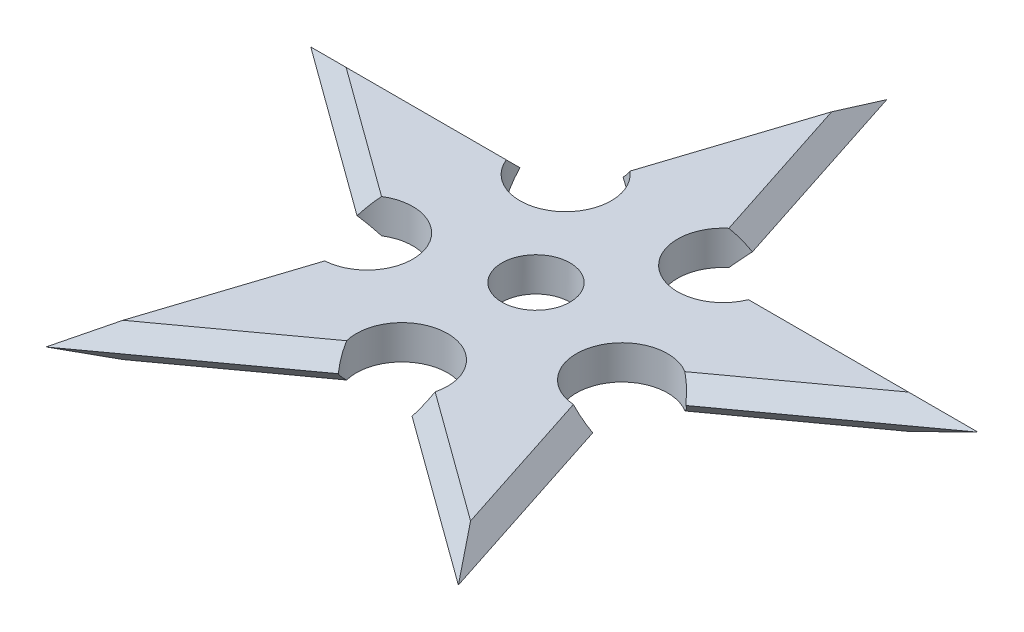
ISO-10303-21;
HEADER;
FILE_DESCRIPTION(('STEP AP214'),'2;1');
FILE_NAME('part.step','',(''),(''),'','','');
FILE_SCHEMA(('AUTOMOTIVE_DESIGN { 1 0 10303 214 1 1 1 1 }'));
ENDSEC;
DATA;
#1=APPLICATION_CONTEXT('core data for automotive mechanical design processes');
#2=APPLICATION_PROTOCOL_DEFINITION('international standard','automotive_design',2000,#1);
#3=PRODUCT_CONTEXT('',#1,'mechanical');
#4=PRODUCT('Part','Part','',(#3));
#5=PRODUCT_RELATED_PRODUCT_CATEGORY('part','',(#4));
#6=PRODUCT_DEFINITION_FORMATION('','',#4);
#7=PRODUCT_DEFINITION_CONTEXT('part definition',#1,'design');
#8=PRODUCT_DEFINITION('design','',#6,#7);
#9=PRODUCT_DEFINITION_SHAPE('','',#8);
#10=(LENGTH_UNIT() NAMED_UNIT(*) SI_UNIT(.MILLI.,.METRE.));
#11=(NAMED_UNIT(*) PLANE_ANGLE_UNIT() SI_UNIT($,.RADIAN.));
#12=(NAMED_UNIT(*) SI_UNIT($,.STERADIAN.) SOLID_ANGLE_UNIT());
#13=UNCERTAINTY_MEASURE_WITH_UNIT(LENGTH_MEASURE(1.E-05),#10,'distance_accuracy_value','');
#14=(GEOMETRIC_REPRESENTATION_CONTEXT(3) GLOBAL_UNCERTAINTY_ASSIGNED_CONTEXT((#13)) GLOBAL_UNIT_ASSIGNED_CONTEXT((#10,
#11,#12)) REPRESENTATION_CONTEXT('',''));
#15=CARTESIAN_POINT('',(0.,0.,0.));
#16=DIRECTION('',(0.,0.,1.));
#17=DIRECTION('',(1.,0.,0.));
#18=AXIS2_PLACEMENT_3D('',#15,#16,#17);
#19=CARTESIAN_POINT('',(6.93786378564481,1.5,-9.54915028125318));
#20=DIRECTION('',(0.,1.,0.));
#21=DIRECTION('',(0.,0.,1.));
#22=AXIS2_PLACEMENT_3D('',#19,#20,#21);
#23=PLANE('',#22);
#24=CARTESIAN_POINT('',(-11.2256994144895,1.5,3.64745084375751));
#25=DIRECTION('',(0.,1.,0.));
#26=DIRECTION('',(0.,0.,1.));
#27=AXIS2_PLACEMENT_3D('',#24,#25,#26);
#28=CIRCLE('',#27,4.02000000000031);
#29=CARTESIAN_POINT('',(-10.9516444664403,1.5,7.65809840811071));
#30=VERTEX_POINT('',#29);
#31=CARTESIAN_POINT('',(-13.3613837945935,1.5,0.241683348965438));
#32=VERTEX_POINT('',#31);
#33=EDGE_CURVE('E817',#30,#32,#28,.T.);
#34=ORIENTED_EDGE('',*,*,#33,.F.);
#35=DIRECTION('',(-0.309016994375039,0.,0.951056516295124));
#36=VECTOR('',#35,1.);
#37=CARTESIAN_POINT('',(-10.9449803231336,1.5,7.63758828396602));
#38=LINE('',#37,#36);
#39=CARTESIAN_POINT('',(-15.3103936512505,1.5,21.0729490168727));
#40=VERTEX_POINT('',#39);
#41=EDGE_CURVE('E375',#30,#40,#38,.T.);
#42=ORIENTED_EDGE('',*,*,#41,.T.);
#43=DIRECTION('',(0.809016994374994,0.,-0.587785252292409));
#44=VECTOR('',#43,1.);
#45=CARTESIAN_POINT('',(-15.3103936512505,1.5,21.0729490168727));
#46=LINE('',#45,#44);
#47=CARTESIAN_POINT('',(-3.89904013698226,1.5,12.7821153866547));
#48=VERTEX_POINT('',#47);
#49=EDGE_CURVE('E371',#40,#48,#46,.T.);
#50=ORIENTED_EDGE('',*,*,#49,.T.);
#51=CARTESIAN_POINT('',(2.4800024458701E-13,1.5,11.8033988749894));
#52=DIRECTION('',(0.,1.,0.));
#53=DIRECTION('',(0.,0.,1.));
#54=AXIS2_PLACEMENT_3D('',#51,#52,#53);
#55=CIRCLE('',#54,4.02000000000086);
#56=CARTESIAN_POINT('',(3.89904013698215,1.5,12.7821153866571));
#57=VERTEX_POINT('',#56);
#58=EDGE_CURVE('E388',#57,#48,#55,.T.);
#59=ORIENTED_EDGE('',*,*,#58,.F.);
#60=DIRECTION('',(0.809016994374945,0.,0.587785252292476));
#61=VECTOR('',#60,1.);
#62=CARTESIAN_POINT('',(3.88159318329884,1.5,12.7694394328221));
#63=LINE('',#62,#61);
#64=CARTESIAN_POINT('',(15.3103936512489,1.5,21.0729490168754));
#65=VERTEX_POINT('',#64);
#66=EDGE_CURVE('E361',#57,#65,#63,.T.);
#67=ORIENTED_EDGE('',*,*,#66,.T.);
#68=DIRECTION('',(-0.309016994374896,0.,-0.95105651629517));
#69=VECTOR('',#68,1.);
#70=CARTESIAN_POINT('',(15.3103936512489,1.5,21.0729490168754));
#71=LINE('',#70,#69);
#72=CARTESIAN_POINT('',(10.9516444664404,1.5,7.65809840811167));
#73=VERTEX_POINT('',#72);
#74=EDGE_CURVE('E78',#65,#73,#71,.T.);
#75=ORIENTED_EDGE('',*,*,#74,.T.);
#76=CARTESIAN_POINT('',(11.2256994144902,1.5,3.64745084375781));
#77=DIRECTION('',(0.,1.,0.));
#78=DIRECTION('',(0.,0.,1.));
#79=AXIS2_PLACEMENT_3D('',#76,#77,#78);
#80=CIRCLE('',#79,4.02000000000102);
#81=CARTESIAN_POINT('',(13.3613837945943,1.5,0.241683348964948));
#82=VERTEX_POINT('',#81);
#83=EDGE_CURVE('E240',#82,#73,#80,.T.);
#84=ORIENTED_EDGE('',*,*,#83,.F.);
#85=DIRECTION('',(0.809016994374994,0.,-0.587785252292409));
#86=VECTOR('',#85,1.);
#87=CARTESIAN_POINT('',(13.343936840911,1.5,0.2543593028));
#88=LINE('',#87,#86);
#89=CARTESIAN_POINT('',(24.772737308862,1.5,-8.04915028125262));
#90=VERTEX_POINT('',#89);
#91=EDGE_CURVE('E261',#82,#90,#88,.T.);
#92=ORIENTED_EDGE('',*,*,#91,.T.);
#93=DIRECTION('',(-1.,0.,0.));
#94=VECTOR('',#93,1.);
#95=CARTESIAN_POINT('',(24.772737308862,1.5,-8.04915028125262));
#96=LINE('',#95,#94);
#97=CARTESIAN_POINT('',(10.6675286499463,1.5,-8.0491502812527));
#98=VERTEX_POINT('',#97);
#99=EDGE_CURVE('E247',#90,#98,#96,.T.);
#100=ORIENTED_EDGE('',*,*,#99,.T.);
#101=CARTESIAN_POINT('',(6.93786378564504,1.5,-9.54915028125299));
#102=DIRECTION('',(0.,1.,0.));
#103=DIRECTION('',(0.,0.,1.));
#104=AXIS2_PLACEMENT_3D('',#101,#102,#103);
#105=CIRCLE('',#104,4.02000000000051);
#106=CARTESIAN_POINT('',(4.35874918481123,1.5,-12.6327468624824));
#107=VERTEX_POINT('',#106);
#108=EDGE_CURVE('E228',#107,#98,#105,.T.);
#109=ORIENTED_EDGE('',*,*,#108,.F.);
#110=DIRECTION('',(-0.309016994374896,0.,-0.95105651629517));
#111=VECTOR('',#110,1.);
#112=CARTESIAN_POINT('',(4.36541332811794,1.5,-12.612236738338));
#113=LINE('',#112,#111);
#114=CARTESIAN_POINT('',(2.64588698173363E-12,1.5,-26.0475974712463));
#115=VERTEX_POINT('',#114);
#116=EDGE_CURVE('E264',#107,#115,#113,.T.);
#117=ORIENTED_EDGE('',*,*,#116,.T.);
#118=DIRECTION('',(-0.309016994375039,0.,0.951056516295124));
#119=VECTOR('',#118,1.);
#120=CARTESIAN_POINT('',(2.64588698173363E-12,1.5,-26.0475974712463));
#121=LINE('',#120,#119);
#122=CARTESIAN_POINT('',(-4.35874918480871,1.5,-12.6327468624807));
#123=VERTEX_POINT('',#122);
#124=EDGE_CURVE('E347',#115,#123,#121,.T.);
#125=ORIENTED_EDGE('',*,*,#124,.T.);
#126=CARTESIAN_POINT('',(-6.93786378564397,1.5,-9.54915028125318));
#127=DIRECTION('',(0.,1.,0.));
#128=DIRECTION('',(0.,0.,1.));
#129=AXIS2_PLACEMENT_3D('',#126,#127,#128);
#130=CIRCLE('',#129,4.02);
#131=CARTESIAN_POINT('',(-10.6675286499446,1.5,-8.04915028125261));
#132=VERTEX_POINT('',#131);
#133=EDGE_CURVE('E991',#132,#123,#130,.T.);
#134=ORIENTED_EDGE('',*,*,#133,.F.);
#135=DIRECTION('',(-1.,0.,0.));
#136=VECTOR('',#135,1.);
#137=CARTESIAN_POINT('',(-10.6459630291925,1.5,-8.04915028125262));
#138=LINE('',#137,#136);
#139=CARTESIAN_POINT('',(-24.7727373088597,1.5,-8.04915028125261));
#140=VERTEX_POINT('',#139);
#141=EDGE_CURVE('E472',#132,#140,#138,.T.);
#142=ORIENTED_EDGE('',*,*,#141,.T.);
#143=DIRECTION('',(0.80901699437494,0.,0.587785252292484));
#144=VECTOR('',#143,1.);
#145=CARTESIAN_POINT('',(-24.7727373088597,1.5,-8.04915028125261));
#146=LINE('',#145,#144);
#147=EDGE_CURVE('E812',#140,#32,#146,.T.);
#148=ORIENTED_EDGE('',*,*,#147,.T.);
#149=EDGE_LOOP('',(#34,#42,#50,#59,#67,#75,#84,#92,#100,#109,#117,#125,#134,#142,#148));
#150=FACE_BOUND('',#149,.T.);
#151=CARTESIAN_POINT('',(0.,1.5,0.));
#152=DIRECTION('',(0.,1.,0.));
#153=DIRECTION('',(0.,0.,1.));
#154=AXIS2_PLACEMENT_3D('',#151,#152,#153);
#155=CIRCLE('',#154,3.);
#156=CARTESIAN_POINT('',(0.,1.5,3.));
#157=VERTEX_POINT('',#156);
#158=EDGE_CURVE('E239',#157,#157,#155,.T.);
#159=ORIENTED_EDGE('',*,*,#158,.F.);
#160=EDGE_LOOP('',(#159));
#161=FACE_BOUND('',#160,.T.);
#162=ADVANCED_FACE('F73',(#150,#161),#23,.T.);
#163=CARTESIAN_POINT('',(2.80642485362174,4.7745751406257,3.86271242968656));
#164=DIRECTION('',(0.415626937777408,0.707106781186548,0.572061402817717));
#165=DIRECTION('',(0.,-0.628960169645115,0.777437524821119));
#166=AXIS2_PLACEMENT_3D('',#163,#164,#165);
#167=PLANE('',#166);
#168=CARTESIAN_POINT('',(11.2256994144902,-9.40220123979429E-13,3.64745084375781));
#169=DIRECTION('',(0.415626937777408,0.707106781186548,0.572061402817717));
#170=DIRECTION('',(-0.415626937777409,0.707106781186547,-0.572061402817717));
#171=AXIS2_PLACEMENT_3D('',#168,#169,#170);
#172=ELLIPSE('',#171,5.68513852074128,4.02000000000102);
#173=CARTESIAN_POINT('',(14.4779477318779,0.,1.28455412954096));
#174=VERTEX_POINT('',#173);
#175=EDGE_CURVE('E521',#174,#82,#172,.T.);
#176=ORIENTED_EDGE('',*,*,#175,.F.);
#177=DIRECTION('',(0.809016994374994,0.,-0.587785252292409));
#178=VECTOR('',#177,1.);
#179=CARTESIAN_POINT('',(14.4617673919904,0.,1.29630983458683));
#180=LINE('',#179,#178);
#181=CARTESIAN_POINT('',(29.3892626146256,0.,-9.54915028125269));
#182=VERTEX_POINT('',#181);
#183=EDGE_CURVE('E523',#174,#182,#180,.T.);
#184=ORIENTED_EDGE('',*,*,#183,.T.);
#185=DIRECTION('',(0.908660854566047,-0.295241808844287,-0.295241808844301));
#186=VECTOR('',#185,1.);
#187=CARTESIAN_POINT('',(24.772737308862,1.5,-8.04915028125262));
#188=LINE('',#187,#186);
#189=EDGE_CURVE('E370',#90,#182,#188,.T.);
#190=ORIENTED_EDGE('',*,*,#189,.F.);
#191=ORIENTED_EDGE('',*,*,#91,.F.);
#192=EDGE_LOOP('',(#176,#184,#190,#191));
#193=FACE_BOUND('',#192,.T.);
#194=ADVANCED_FACE('F286',(#193),#167,.T.);
#195=CARTESIAN_POINT('',(0.,4.77457514062653,-4.77457514062602));
#196=DIRECTION('',(0.,0.707106781186585,-0.70710678118651));
#197=DIRECTION('',(0.,0.70710678118651,0.707106781186585));
#198=AXIS2_PLACEMENT_3D('',#195,#196,#197);
#199=PLANE('',#198);
#200=CARTESIAN_POINT('',(6.93786378564504,0.,-9.54915028125299));
#201=DIRECTION('',(0.,0.707106781186585,-0.70710678118651));
#202=DIRECTION('',(0.,0.70710678118651,0.707106781186585));
#203=AXIS2_PLACEMENT_3D('',#200,#201,#202);
#204=ELLIPSE('',#203,5.68513852074027,4.02000000000051);
#205=CARTESIAN_POINT('',(10.9578637856456,0.,-9.54915028125284));
#206=VERTEX_POINT('',#205);
#207=EDGE_CURVE('E231',#98,#206,#204,.T.);
#208=ORIENTED_EDGE('',*,*,#207,.F.);
#209=ORIENTED_EDGE('',*,*,#99,.F.);
#210=ORIENTED_EDGE('',*,*,#189,.T.);
#211=DIRECTION('',(-1.,0.,0.));
#212=VECTOR('',#211,1.);
#213=CARTESIAN_POINT('',(10.9378637856456,0.,-9.54915028125284));
#214=LINE('',#213,#212);
#215=EDGE_CURVE('E251',#182,#206,#214,.T.);
#216=ORIENTED_EDGE('',*,*,#215,.T.);
#217=EDGE_LOOP('',(#208,#209,#210,#216));
#218=FACE_BOUND('',#217,.T.);
#219=ADVANCED_FACE('F245',(#218),#199,.T.);
#220=CARTESIAN_POINT('',(4.54089080003433,4.7745751406271,-1.47542485937368));
#221=DIRECTION('',(0.672498511963969,0.707106781186548,-0.218508012224374));
#222=DIRECTION('',(-0.724617040067441,0.689151757774658,0.));
#223=AXIS2_PLACEMENT_3D('',#220,#221,#222);
#224=PLANE('',#223);
#225=CARTESIAN_POINT('',(11.2256994144902,6.50521303491303E-13,3.64745084375781));
#226=DIRECTION('',(0.672498511963969,0.707106781186548,-0.218508012224374));
#227=DIRECTION('',(-0.67249851196397,0.707106781186547,0.218508012224374));
#228=AXIS2_PLACEMENT_3D('',#225,#226,#227);
#229=ELLIPSE('',#228,5.68513852074128,4.02000000000102);
#230=CARTESIAN_POINT('',(12.4679477318782,0.,7.47069803926516));
#231=VERTEX_POINT('',#230);
#232=EDGE_CURVE('E92',#73,#231,#229,.T.);
#233=ORIENTED_EDGE('',*,*,#232,.F.);
#234=ORIENTED_EDGE('',*,*,#74,.F.);
#235=DIRECTION('',(0.561583292368303,-0.295241808844347,0.772953090454457));
#236=VECTOR('',#235,1.);
#237=CARTESIAN_POINT('',(15.3103936512489,1.5,21.0729490168754));
#238=LINE('',#237,#236);
#239=CARTESIAN_POINT('',(18.163563200134,0.,25.0000000000001));
#240=VERTEX_POINT('',#239);
#241=EDGE_CURVE('E409',#65,#240,#238,.T.);
#242=ORIENTED_EDGE('',*,*,#241,.T.);
#243=DIRECTION('',(-0.309016994374896,0.,-0.95105651629517));
#244=VECTOR('',#243,1.);
#245=CARTESIAN_POINT('',(18.163563200134,0.,25.0000000000001));
#246=LINE('',#245,#244);
#247=EDGE_CURVE('E528',#240,#231,#246,.T.);
#248=ORIENTED_EDGE('',*,*,#247,.T.);
#249=EDGE_LOOP('',(#233,#234,#242,#248));
#250=FACE_BOUND('',#249,.T.);
#251=ADVANCED_FACE('F490',(#250),#224,.T.);
#252=CARTESIAN_POINT('',(-2.8064248536224,4.77457514062628,3.8627124296868));
#253=DIRECTION('',(-0.415626937777456,0.707106781186548,0.572061402817683));
#254=DIRECTION('',(0.,-0.628960169645093,0.777437524821137));
#255=AXIS2_PLACEMENT_3D('',#252,#253,#254);
#256=PLANE('',#255);
#257=CARTESIAN_POINT('',(2.4800024458701E-13,1.75207071073658E-13,11.8033988749894));
#258=DIRECTION('',(-0.415626937777456,0.707106781186548,0.572061402817683));
#259=DIRECTION('',(0.415626937777456,0.707106781186547,-0.572061402817683));
#260=AXIS2_PLACEMENT_3D('',#257,#258,#259);
#261=ELLIPSE('',#260,5.68513852074106,4.02000000000086);
#262=CARTESIAN_POINT('',(3.25224831738812,0.,14.1662955892058));
#263=VERTEX_POINT('',#262);
#264=EDGE_CURVE('E898',#263,#57,#261,.T.);
#265=ORIENTED_EDGE('',*,*,#264,.F.);
#266=DIRECTION('',(0.809016994374945,0.,0.587785252292476));
#267=VECTOR('',#266,1.);
#268=CARTESIAN_POINT('',(3.2360679775008,0.,14.1545398841601));
#269=LINE('',#268,#267);
#270=EDGE_CURVE('E696',#263,#240,#269,.T.);
#271=ORIENTED_EDGE('',*,*,#270,.T.);
#272=ORIENTED_EDGE('',*,*,#241,.F.);
#273=ORIENTED_EDGE('',*,*,#66,.F.);
#274=EDGE_LOOP('',(#265,#271,#272,#273));
#275=FACE_BOUND('',#274,.T.);
#276=ADVANCED_FACE('F481',(#275),#256,.T.);
#277=CARTESIAN_POINT('',(2.80642485362175,4.7745751406257,3.86271242968658));
#278=DIRECTION('',(0.415626937777409,0.707106781186547,0.572061402817718));
#279=DIRECTION('',(0.,-0.628960169645117,0.777437524821118));
#280=AXIS2_PLACEMENT_3D('',#277,#278,#279);
#281=PLANE('',#280);
#282=CARTESIAN_POINT('',(2.4800024458701E-13,-1.84401105496335E-12,11.8033988749894));
#283=DIRECTION('',(0.415626937777409,0.707106781186547,0.572061402817718));
#284=DIRECTION('',(-0.415626937777408,0.707106781186548,-0.572061402817716));
#285=AXIS2_PLACEMENT_3D('',#282,#283,#284);
#286=ELLIPSE('',#285,5.68513852074107,4.02000000000086);
#287=CARTESIAN_POINT('',(-3.25224831738901,0.,14.1662955892039));
#288=VERTEX_POINT('',#287);
#289=EDGE_CURVE('E100',#48,#288,#286,.T.);
#290=ORIENTED_EDGE('',*,*,#289,.F.);
#291=ORIENTED_EDGE('',*,*,#49,.F.);
#292=DIRECTION('',(-0.561583292368398,-0.295241808844319,0.772953090454398));
#293=VECTOR('',#292,1.);
#294=CARTESIAN_POINT('',(-15.3103936512505,1.5,21.0729490168727));
#295=LINE('',#294,#293);
#296=CARTESIAN_POINT('',(-18.1635632001364,0.,24.9999999999974));
#297=VERTEX_POINT('',#296);
#298=EDGE_CURVE('E397',#40,#297,#295,.T.);
#299=ORIENTED_EDGE('',*,*,#298,.T.);
#300=DIRECTION('',(0.809016994374994,0.,-0.58778525229241));
#301=VECTOR('',#300,1.);
#302=CARTESIAN_POINT('',(-18.1635632001364,0.,24.9999999999974));
#303=LINE('',#302,#301);
#304=EDGE_CURVE('E836',#297,#288,#303,.T.);
#305=ORIENTED_EDGE('',*,*,#304,.T.);
#306=EDGE_LOOP('',(#290,#291,#299,#305));
#307=FACE_BOUND('',#306,.T.);
#308=ADVANCED_FACE('F395',(#307),#281,.T.);
#309=CARTESIAN_POINT('',(-4.54089080003349,4.77457514062644,-1.47542485937416));
#310=DIRECTION('',(-0.672498511963937,0.707106781186547,-0.218508012224475));
#311=DIRECTION('',(-0.724617040067457,-0.689151757774641,0.));
#312=AXIS2_PLACEMENT_3D('',#309,#310,#311);
#313=PLANE('',#312);
#314=CARTESIAN_POINT('',(-11.2256994144895,9.62771529167128E-13,3.64745084375751));
#315=DIRECTION('',(-0.672498511963937,0.707106781186547,-0.218508012224475));
#316=DIRECTION('',(0.672498511963936,0.707106781186548,0.218508012224475));
#317=AXIS2_PLACEMENT_3D('',#314,#315,#316);
#318=ELLIPSE('',#317,5.68513852074028,4.02000000000031);
#319=CARTESIAN_POINT('',(-12.4679477318781,0.,7.4706980392639));
#320=VERTEX_POINT('',#319);
#321=EDGE_CURVE('E948',#320,#30,#318,.T.);
#322=ORIENTED_EDGE('',*,*,#321,.F.);
#323=DIRECTION('',(-0.309016994375039,0.,0.951056516295124));
#324=VECTOR('',#323,1.);
#325=CARTESIAN_POINT('',(-18.1635632001364,0.,24.9999999999974));
#326=LINE('',#325,#324);
#327=EDGE_CURVE('E405',#320,#297,#326,.T.);
#328=ORIENTED_EDGE('',*,*,#327,.T.);
#329=ORIENTED_EDGE('',*,*,#298,.F.);
#330=ORIENTED_EDGE('',*,*,#41,.F.);
#331=EDGE_LOOP('',(#322,#328,#329,#330));
#332=FACE_BOUND('',#331,.T.);
#333=ADVANCED_FACE('F402',(#332),#313,.T.);
#334=CARTESIAN_POINT('',(-2.80642485362236,4.77457514062615,3.86271242968668));
#335=DIRECTION('',(-0.415626937777461,0.707106781186548,0.572061402817679));
#336=DIRECTION('',(0.,-0.628960169645091,0.777437524821139));
#337=AXIS2_PLACEMENT_3D('',#334,#335,#336);
#338=PLANE('',#337);
#339=CARTESIAN_POINT('',(-11.2256994144895,0.,3.64745084375751));
#340=DIRECTION('',(-0.415626937777461,0.707106781186548,0.572061402817679));
#341=DIRECTION('',(0.415626937777461,0.707106781186548,-0.572061402817679));
#342=AXIS2_PLACEMENT_3D('',#339,#340,#341);
#343=ELLIPSE('',#342,5.68513852074027,4.02000000000031);
#344=CARTESIAN_POINT('',(-14.477947731877,0.,1.28455412954154));
#345=VERTEX_POINT('',#344);
#346=EDGE_CURVE('E821',#32,#345,#343,.T.);
#347=ORIENTED_EDGE('',*,*,#346,.F.);
#348=ORIENTED_EDGE('',*,*,#147,.F.);
#349=DIRECTION('',(-0.908660854566019,-0.29524180884428,-0.295241808844392));
#350=VECTOR('',#349,1.);
#351=CARTESIAN_POINT('',(-24.7727373088597,1.5,-8.04915028125261));
#352=LINE('',#351,#350);
#353=CARTESIAN_POINT('',(-29.3892626146232,0.,-9.54915028125318));
#354=VERTEX_POINT('',#353);
#355=EDGE_CURVE('E408',#140,#354,#352,.T.);
#356=ORIENTED_EDGE('',*,*,#355,.T.);
#357=DIRECTION('',(0.80901699437494,0.,0.587785252292483));
#358=VECTOR('',#357,1.);
#359=CARTESIAN_POINT('',(-29.3892626146232,0.,-9.54915028125318));
#360=LINE('',#359,#358);
#361=EDGE_CURVE('E826',#354,#345,#360,.T.);
#362=ORIENTED_EDGE('',*,*,#361,.T.);
#363=EDGE_LOOP('',(#347,#348,#356,#362));
#364=FACE_BOUND('',#363,.T.);
#365=ADVANCED_FACE('F437',(#364),#338,.T.);
#366=CARTESIAN_POINT('',(1.46785597404099E-13,4.77457514062614,-4.77457514062617));
#367=DIRECTION('',(0.,0.707106781186545,-0.70710678118655));
#368=DIRECTION('',(0.,0.70710678118655,0.707106781186545));
#369=AXIS2_PLACEMENT_3D('',#366,#367,#368);
#370=PLANE('',#369);
#371=CARTESIAN_POINT('',(-6.93786378564397,-6.90419943438769E-13,-9.54915028125318));
#372=DIRECTION('',(0.,0.707106781186545,-0.70710678118655));
#373=DIRECTION('',(0.,0.70710678118655,0.707106781186545));
#374=AXIS2_PLACEMENT_3D('',#371,#372,#373);
#375=ELLIPSE('',#374,5.68513852073986,4.02);
#376=CARTESIAN_POINT('',(-10.957863785644,0.,-9.54915028125261));
#377=VERTEX_POINT('',#376);
#378=EDGE_CURVE('E824',#377,#132,#375,.T.);
#379=ORIENTED_EDGE('',*,*,#378,.F.);
#380=DIRECTION('',(-1.,0.,0.));
#381=VECTOR('',#380,1.);
#382=CARTESIAN_POINT('',(-29.3892626146232,0.,-9.54915028125318));
#383=LINE('',#382,#381);
#384=EDGE_CURVE('E823',#377,#354,#383,.T.);
#385=ORIENTED_EDGE('',*,*,#384,.T.);
#386=ORIENTED_EDGE('',*,*,#355,.F.);
#387=ORIENTED_EDGE('',*,*,#141,.F.);
#388=EDGE_LOOP('',(#379,#385,#386,#387));
#389=FACE_BOUND('',#388,.T.);
#390=ADVANCED_FACE('F443',(#389),#370,.T.);
#391=CARTESIAN_POINT('',(-4.54089080003349,4.77457514062644,-1.47542485937416));
#392=DIRECTION('',(-0.672498511963937,0.707106781186547,-0.218508012224475));
#393=DIRECTION('',(-0.724617040067457,-0.689151757774641,0.));
#394=AXIS2_PLACEMENT_3D('',#391,#392,#393);
#395=PLANE('',#394);
#396=CARTESIAN_POINT('',(-6.93786378564397,-1.90819582357449E-13,-9.54915028125318));
#397=DIRECTION('',(-0.672498511963937,0.707106781186547,-0.218508012224475));
#398=DIRECTION('',(0.672498511963936,0.707106781186548,0.218508012224475));
#399=AXIS2_PLACEMENT_3D('',#396,#397,#398);
#400=ELLIPSE('',#399,5.68513852073985,4.02);
#401=CARTESIAN_POINT('',(-5.69561546825614,0.,-13.3723974767595));
#402=VERTEX_POINT('',#401);
#403=EDGE_CURVE('E982',#123,#402,#400,.T.);
#404=ORIENTED_EDGE('',*,*,#403,.F.);
#405=ORIENTED_EDGE('',*,*,#124,.F.);
#406=DIRECTION('',(0.,-0.295241808844344,-0.955422563220233));
#407=VECTOR('',#406,1.);
#408=CARTESIAN_POINT('',(2.64588698173363E-12,1.5,-26.0475974712463));
#409=LINE('',#408,#407);
#410=CARTESIAN_POINT('',(3.01044587288946E-12,0.,-30.9016994374957));
#411=VERTEX_POINT('',#410);
#412=EDGE_CURVE('E414',#115,#411,#409,.T.);
#413=ORIENTED_EDGE('',*,*,#412,.T.);
#414=DIRECTION('',(-0.309016994375039,0.,0.951056516295124));
#415=VECTOR('',#414,1.);
#416=CARTESIAN_POINT('',(-5.70179580814339,0.,-13.3533763464344));
#417=LINE('',#416,#415);
#418=EDGE_CURVE('E275',#411,#402,#417,.T.);
#419=ORIENTED_EDGE('',*,*,#418,.T.);
#420=EDGE_LOOP('',(#404,#405,#413,#419));
#421=FACE_BOUND('',#420,.T.);
#422=ADVANCED_FACE('F1140',(#421),#395,.T.);
#423=CARTESIAN_POINT('',(4.54089080003433,4.7745751406271,-1.47542485937368));
#424=DIRECTION('',(0.672498511963969,0.707106781186548,-0.218508012224374));
#425=DIRECTION('',(-0.724617040067441,0.689151757774658,0.));
#426=AXIS2_PLACEMENT_3D('',#423,#424,#425);
#427=PLANE('',#426);
#428=CARTESIAN_POINT('',(6.93786378564504,1.21083698623181E-12,-9.54915028125299));
#429=DIRECTION('',(0.672498511963969,0.707106781186548,-0.218508012224374));
#430=DIRECTION('',(-0.672498511963969,0.707106781186547,0.218508012224374));
#431=AXIS2_PLACEMENT_3D('',#428,#429,#430);
#432=ELLIPSE('',#431,5.68513852074057,4.02000000000051);
#433=CARTESIAN_POINT('',(5.69561546825895,0.,-13.3723974767604));
#434=VERTEX_POINT('',#433);
#435=EDGE_CURVE('E234',#434,#107,#432,.T.);
#436=ORIENTED_EDGE('',*,*,#435,.F.);
#437=DIRECTION('',(-0.309016994374896,0.,-0.95105651629517));
#438=VECTOR('',#437,1.);
#439=CARTESIAN_POINT('',(5.70179580814628,0.,-13.3533763464351));
#440=LINE('',#439,#438);
#441=EDGE_CURVE('E556',#434,#411,#440,.T.);
#442=ORIENTED_EDGE('',*,*,#441,.T.);
#443=ORIENTED_EDGE('',*,*,#412,.F.);
#444=ORIENTED_EDGE('',*,*,#116,.F.);
#445=EDGE_LOOP('',(#436,#442,#443,#444));
#446=FACE_BOUND('',#445,.T.);
#447=ADVANCED_FACE('F75',(#446),#427,.T.);
#448=CARTESIAN_POINT('',(6.93786378564481,-1.5,-9.54915028125318));
#449=DIRECTION('',(0.,-1.,0.));
#450=DIRECTION('',(0.,0.,1.));
#451=AXIS2_PLACEMENT_3D('',#448,#449,#450);
#452=PLANE('',#451);
#453=CARTESIAN_POINT('',(-11.2256994144895,-1.5,3.64745084375751));
#454=DIRECTION('',(0.,-1.,0.));
#455=DIRECTION('',(0.,0.,-1.));
#456=AXIS2_PLACEMENT_3D('',#453,#454,#455);
#457=CIRCLE('',#456,4.02000000000031);
#458=CARTESIAN_POINT('',(-13.3613837945935,-1.5,0.241683348965439));
#459=VERTEX_POINT('',#458);
#460=CARTESIAN_POINT('',(-10.9516444664403,-1.5,7.65809840811071));
#461=VERTEX_POINT('',#460);
#462=EDGE_CURVE('E964',#459,#461,#457,.T.);
#463=ORIENTED_EDGE('',*,*,#462,.F.);
#464=DIRECTION('',(0.80901699437494,0.,0.587785252292484));
#465=VECTOR('',#464,1.);
#466=CARTESIAN_POINT('',(-24.7727373088597,-1.5,-8.04915028125261));
#467=LINE('',#466,#465);
#468=CARTESIAN_POINT('',(-24.7727373088597,-1.5,-8.04915028125261));
#469=VERTEX_POINT('',#468);
#470=EDGE_CURVE('E809',#469,#459,#467,.T.);
#471=ORIENTED_EDGE('',*,*,#470,.F.);
#472=DIRECTION('',(-1.,0.,0.));
#473=VECTOR('',#472,1.);
#474=CARTESIAN_POINT('',(-10.6459630291925,-1.5,-8.04915028125262));
#475=LINE('',#474,#473);
#476=CARTESIAN_POINT('',(-10.6675286499446,-1.5,-8.04915028125262));
#477=VERTEX_POINT('',#476);
#478=EDGE_CURVE('E579',#477,#469,#475,.T.);
#479=ORIENTED_EDGE('',*,*,#478,.F.);
#480=CARTESIAN_POINT('',(-6.93786378564397,-1.5,-9.54915028125318));
#481=DIRECTION('',(0.,-1.,0.));
#482=DIRECTION('',(0.,0.,-1.));
#483=AXIS2_PLACEMENT_3D('',#480,#481,#482);
#484=CIRCLE('',#483,4.02);
#485=CARTESIAN_POINT('',(-4.35874918480871,-1.5,-12.6327468624808));
#486=VERTEX_POINT('',#485);
#487=EDGE_CURVE('E253',#486,#477,#484,.T.);
#488=ORIENTED_EDGE('',*,*,#487,.F.);
#489=DIRECTION('',(-0.309016994375039,0.,0.951056516295124));
#490=VECTOR('',#489,1.);
#491=CARTESIAN_POINT('',(2.64588698173363E-12,-1.5,-26.0475974712463));
#492=LINE('',#491,#490);
#493=CARTESIAN_POINT('',(2.64588698173363E-12,-1.5,-26.0475974712463));
#494=VERTEX_POINT('',#493);
#495=EDGE_CURVE('E768',#494,#486,#492,.T.);
#496=ORIENTED_EDGE('',*,*,#495,.F.);
#497=DIRECTION('',(-0.309016994374896,0.,-0.95105651629517));
#498=VECTOR('',#497,1.);
#499=CARTESIAN_POINT('',(4.36541332811794,-1.5,-12.612236738338));
#500=LINE('',#499,#498);
#501=CARTESIAN_POINT('',(4.35874918481123,-1.5,-12.6327468624825));
#502=VERTEX_POINT('',#501);
#503=EDGE_CURVE('E348',#502,#494,#500,.T.);
#504=ORIENTED_EDGE('',*,*,#503,.F.);
#505=CARTESIAN_POINT('',(6.93786378564504,-1.5,-9.54915028125299));
#506=DIRECTION('',(0.,-1.,0.));
#507=DIRECTION('',(0.,0.,-1.));
#508=AXIS2_PLACEMENT_3D('',#505,#506,#507);
#509=CIRCLE('',#508,4.02000000000051);
#510=CARTESIAN_POINT('',(10.6675286499452,-1.5,-8.04915028125005));
#511=VERTEX_POINT('',#510);
#512=EDGE_CURVE('E763',#511,#502,#509,.T.);
#513=ORIENTED_EDGE('',*,*,#512,.F.);
#514=DIRECTION('',(-1.,0.,0.));
#515=VECTOR('',#514,1.);
#516=CARTESIAN_POINT('',(24.772737308862,-1.5,-8.04915028125262));
#517=LINE('',#516,#515);
#518=CARTESIAN_POINT('',(24.772737308862,-1.5,-8.04915028125262));
#519=VERTEX_POINT('',#518);
#520=EDGE_CURVE('E352',#519,#511,#517,.T.);
#521=ORIENTED_EDGE('',*,*,#520,.F.);
#522=DIRECTION('',(0.809016994374994,0.,-0.587785252292409));
#523=VECTOR('',#522,1.);
#524=CARTESIAN_POINT('',(13.343936840911,-1.5,0.2543593028));
#525=LINE('',#524,#523);
#526=CARTESIAN_POINT('',(13.3613837945943,-1.5,0.241683348964947));
#527=VERTEX_POINT('',#526);
#528=EDGE_CURVE('E534',#527,#519,#525,.T.);
#529=ORIENTED_EDGE('',*,*,#528,.F.);
#530=CARTESIAN_POINT('',(11.2256994144902,-1.5,3.64745084375781));
#531=DIRECTION('',(0.,-1.,0.));
#532=DIRECTION('',(0.,0.,-1.));
#533=AXIS2_PLACEMENT_3D('',#530,#531,#532);
#534=CIRCLE('',#533,4.02000000000102);
#535=CARTESIAN_POINT('',(10.9516444664404,-1.5,7.65809840811167));
#536=VERTEX_POINT('',#535);
#537=EDGE_CURVE('E896',#536,#527,#534,.T.);
#538=ORIENTED_EDGE('',*,*,#537,.F.);
#539=DIRECTION('',(-0.309016994374896,0.,-0.95105651629517));
#540=VECTOR('',#539,1.);
#541=CARTESIAN_POINT('',(15.3103936512489,-1.5,21.0729490168754));
#542=LINE('',#541,#540);
#543=CARTESIAN_POINT('',(15.3103936512489,-1.5,21.0729490168754));
#544=VERTEX_POINT('',#543);
#545=EDGE_CURVE('E383',#544,#536,#542,.T.);
#546=ORIENTED_EDGE('',*,*,#545,.F.);
#547=DIRECTION('',(0.809016994374945,0.,0.587785252292476));
#548=VECTOR('',#547,1.);
#549=CARTESIAN_POINT('',(3.88159318329884,-1.5,12.7694394328221));
#550=LINE('',#549,#548);
#551=CARTESIAN_POINT('',(3.89904013698215,-1.5,12.7821153866571));
#552=VERTEX_POINT('',#551);
#553=EDGE_CURVE('E378',#552,#544,#550,.T.);
#554=ORIENTED_EDGE('',*,*,#553,.F.);
#555=CARTESIAN_POINT('',(2.4800024458701E-13,-1.5,11.8033988749894));
#556=DIRECTION('',(0.,-1.,0.));
#557=DIRECTION('',(0.,0.,-1.));
#558=AXIS2_PLACEMENT_3D('',#555,#556,#557);
#559=CIRCLE('',#558,4.02000000000086);
#560=CARTESIAN_POINT('',(-3.89904013698226,-1.5,12.7821153866547));
#561=VERTEX_POINT('',#560);
#562=EDGE_CURVE('E943',#561,#552,#559,.T.);
#563=ORIENTED_EDGE('',*,*,#562,.F.);
#564=DIRECTION('',(0.809016994374994,0.,-0.587785252292409));
#565=VECTOR('',#564,1.);
#566=CARTESIAN_POINT('',(-15.3103936512505,-1.5,21.0729490168727));
#567=LINE('',#566,#565);
#568=CARTESIAN_POINT('',(-15.3103936512505,-1.5,21.0729490168727));
#569=VERTEX_POINT('',#568);
#570=EDGE_CURVE('E802',#569,#561,#567,.T.);
#571=ORIENTED_EDGE('',*,*,#570,.F.);
#572=DIRECTION('',(-0.309016994375039,0.,0.951056516295124));
#573=VECTOR('',#572,1.);
#574=CARTESIAN_POINT('',(-10.9449803231336,-1.5,7.63758828396602));
#575=LINE('',#574,#573);
#576=EDGE_CURVE('E804',#461,#569,#575,.T.);
#577=ORIENTED_EDGE('',*,*,#576,.F.);
#578=EDGE_LOOP('',(#463,#471,#479,#488,#496,#504,#513,#521,#529,#538,#546,#554,#563,#571,#577));
#579=FACE_BOUND('',#578,.T.);
#580=CARTESIAN_POINT('',(0.,-1.5,0.));
#581=DIRECTION('',(0.,-1.,0.));
#582=DIRECTION('',(0.,0.,-1.));
#583=AXIS2_PLACEMENT_3D('',#580,#581,#582);
#584=CIRCLE('',#583,3.);
#585=CARTESIAN_POINT('',(0.,-1.5,-3.));
#586=VERTEX_POINT('',#585);
#587=EDGE_CURVE('E765',#586,#586,#584,.T.);
#588=ORIENTED_EDGE('',*,*,#587,.F.);
#589=EDGE_LOOP('',(#588));
#590=FACE_BOUND('',#589,.T.);
#591=ADVANCED_FACE('F705',(#579,#590),#452,.T.);
#592=CARTESIAN_POINT('',(2.80642485362174,-4.7745751406257,3.86271242968656));
#593=DIRECTION('',(0.415626937777408,-0.707106781186548,0.572061402817717));
#594=DIRECTION('',(0.,0.628960169645115,0.777437524821119));
#595=AXIS2_PLACEMENT_3D('',#592,#593,#594);
#596=PLANE('',#595);
#597=CARTESIAN_POINT('',(11.2256994144902,9.40220123979429E-13,3.64745084375781));
#598=DIRECTION('',(0.415626937777408,-0.707106781186548,0.572061402817717));
#599=DIRECTION('',(0.415626937777409,0.707106781186547,0.572061402817717));
#600=AXIS2_PLACEMENT_3D('',#597,#598,#599);
#601=ELLIPSE('',#600,5.68513852074128,4.02000000000102);
#602=EDGE_CURVE('E774',#527,#174,#601,.T.);
#603=ORIENTED_EDGE('',*,*,#602,.F.);
#604=ORIENTED_EDGE('',*,*,#528,.T.);
#605=DIRECTION('',(0.908660854566047,0.295241808844287,-0.295241808844301));
#606=VECTOR('',#605,1.);
#607=CARTESIAN_POINT('',(24.772737308862,-1.5,-8.04915028125262));
#608=LINE('',#607,#606);
#609=EDGE_CURVE('E531',#519,#182,#608,.T.);
#610=ORIENTED_EDGE('',*,*,#609,.T.);
#611=ORIENTED_EDGE('',*,*,#183,.F.);
#612=EDGE_LOOP('',(#603,#604,#610,#611));
#613=FACE_BOUND('',#612,.T.);
#614=ADVANCED_FACE('F532',(#613),#596,.T.);
#615=CARTESIAN_POINT('',(0.,-4.77457514062653,-4.77457514062602));
#616=DIRECTION('',(0.,-0.707106781186585,-0.70710678118651));
#617=DIRECTION('',(0.,-0.70710678118651,0.707106781186585));
#618=AXIS2_PLACEMENT_3D('',#615,#616,#617);
#619=PLANE('',#618);
#620=CARTESIAN_POINT('',(6.93786378564504,0.,-9.54915028125299));
#621=DIRECTION('',(0.,-0.707106781186585,-0.70710678118651));
#622=DIRECTION('',(0.,0.70710678118651,-0.707106781186585));
#623=AXIS2_PLACEMENT_3D('',#620,#621,#622);
#624=ELLIPSE('',#623,5.68513852074027,4.02000000000051);
#625=EDGE_CURVE('E254',#206,#511,#624,.T.);
#626=ORIENTED_EDGE('',*,*,#625,.F.);
#627=ORIENTED_EDGE('',*,*,#215,.F.);
#628=ORIENTED_EDGE('',*,*,#609,.F.);
#629=ORIENTED_EDGE('',*,*,#520,.T.);
#630=EDGE_LOOP('',(#626,#627,#628,#629));
#631=FACE_BOUND('',#630,.T.);
#632=ADVANCED_FACE('F542',(#631),#619,.T.);
#633=CARTESIAN_POINT('',(4.54089080003433,-4.7745751406271,-1.47542485937368));
#634=DIRECTION('',(0.672498511963969,-0.707106781186548,-0.218508012224374));
#635=DIRECTION('',(-0.724617040067441,-0.689151757774658,0.));
#636=AXIS2_PLACEMENT_3D('',#633,#634,#635);
#637=PLANE('',#636);
#638=CARTESIAN_POINT('',(11.2256994144902,-6.50521303491303E-13,3.64745084375781));
#639=DIRECTION('',(0.672498511963969,-0.707106781186548,-0.218508012224374));
#640=DIRECTION('',(0.67249851196397,0.707106781186547,-0.218508012224374));
#641=AXIS2_PLACEMENT_3D('',#638,#639,#640);
#642=ELLIPSE('',#641,5.68513852074128,4.02000000000102);
#643=EDGE_CURVE('E12',#231,#536,#642,.T.);
#644=ORIENTED_EDGE('',*,*,#643,.F.);
#645=ORIENTED_EDGE('',*,*,#247,.F.);
#646=DIRECTION('',(0.561583292368303,0.295241808844347,0.772953090454457));
#647=VECTOR('',#646,1.);
#648=CARTESIAN_POINT('',(15.3103936512489,-1.5,21.0729490168754));
#649=LINE('',#648,#647);
#650=EDGE_CURVE('E540',#544,#240,#649,.T.);
#651=ORIENTED_EDGE('',*,*,#650,.F.);
#652=ORIENTED_EDGE('',*,*,#545,.T.);
#653=EDGE_LOOP('',(#644,#645,#651,#652));
#654=FACE_BOUND('',#653,.T.);
#655=ADVANCED_FACE('F645',(#654),#637,.T.);
#656=CARTESIAN_POINT('',(-2.8064248536224,-4.77457514062628,3.8627124296868));
#657=DIRECTION('',(-0.415626937777456,-0.707106781186548,0.572061402817683));
#658=DIRECTION('',(0.,0.628960169645093,0.777437524821137));
#659=AXIS2_PLACEMENT_3D('',#656,#657,#658);
#660=PLANE('',#659);
#661=CARTESIAN_POINT('',(2.4800024458701E-13,-1.75207071073658E-13,11.8033988749894));
#662=DIRECTION('',(-0.415626937777456,-0.707106781186548,0.572061402817683));
#663=DIRECTION('',(-0.415626937777456,0.707106781186547,0.572061402817683));
#664=AXIS2_PLACEMENT_3D('',#661,#662,#663);
#665=ELLIPSE('',#664,5.68513852074106,4.02000000000086);
#666=EDGE_CURVE('E903',#552,#263,#665,.T.);
#667=ORIENTED_EDGE('',*,*,#666,.F.);
#668=ORIENTED_EDGE('',*,*,#553,.T.);
#669=ORIENTED_EDGE('',*,*,#650,.T.);
#670=ORIENTED_EDGE('',*,*,#270,.F.);
#671=EDGE_LOOP('',(#667,#668,#669,#670));
#672=FACE_BOUND('',#671,.T.);
#673=ADVANCED_FACE('F650',(#672),#660,.T.);
#674=CARTESIAN_POINT('',(2.80642485362175,-4.7745751406257,3.86271242968658));
#675=DIRECTION('',(0.415626937777409,-0.707106781186547,0.572061402817718));
#676=DIRECTION('',(0.,0.628960169645117,0.777437524821118));
#677=AXIS2_PLACEMENT_3D('',#674,#675,#676);
#678=PLANE('',#677);
#679=CARTESIAN_POINT('',(2.4800024458701E-13,1.84401105496335E-12,11.8033988749894));
#680=DIRECTION('',(0.415626937777409,-0.707106781186547,0.572061402817718));
#681=DIRECTION('',(0.415626937777408,0.707106781186548,0.572061402817716));
#682=AXIS2_PLACEMENT_3D('',#679,#680,#681);
#683=ELLIPSE('',#682,5.68513852074107,4.02000000000086);
#684=EDGE_CURVE('E85',#288,#561,#683,.T.);
#685=ORIENTED_EDGE('',*,*,#684,.F.);
#686=ORIENTED_EDGE('',*,*,#304,.F.);
#687=DIRECTION('',(-0.561583292368398,0.295241808844319,0.772953090454398));
#688=VECTOR('',#687,1.);
#689=CARTESIAN_POINT('',(-15.3103936512505,-1.5,21.0729490168727));
#690=LINE('',#689,#688);
#691=EDGE_CURVE('E669',#569,#297,#690,.T.);
#692=ORIENTED_EDGE('',*,*,#691,.F.);
#693=ORIENTED_EDGE('',*,*,#570,.T.);
#694=EDGE_LOOP('',(#685,#686,#692,#693));
#695=FACE_BOUND('',#694,.T.);
#696=ADVANCED_FACE('F873',(#695),#678,.T.);
#697=CARTESIAN_POINT('',(-4.54089080003349,-4.77457514062644,-1.47542485937416));
#698=DIRECTION('',(-0.672498511963937,-0.707106781186547,-0.218508012224475));
#699=DIRECTION('',(-0.724617040067457,0.689151757774641,0.));
#700=AXIS2_PLACEMENT_3D('',#697,#698,#699);
#701=PLANE('',#700);
#702=CARTESIAN_POINT('',(-11.2256994144895,-9.62771529167128E-13,3.64745084375751));
#703=DIRECTION('',(-0.672498511963937,-0.707106781186547,-0.218508012224475));
#704=DIRECTION('',(-0.672498511963936,0.707106781186548,-0.218508012224475));
#705=AXIS2_PLACEMENT_3D('',#702,#703,#704);
#706=ELLIPSE('',#705,5.68513852074028,4.02000000000031);
#707=EDGE_CURVE('E955',#461,#320,#706,.T.);
#708=ORIENTED_EDGE('',*,*,#707,.F.);
#709=ORIENTED_EDGE('',*,*,#576,.T.);
#710=ORIENTED_EDGE('',*,*,#691,.T.);
#711=ORIENTED_EDGE('',*,*,#327,.F.);
#712=EDGE_LOOP('',(#708,#709,#710,#711));
#713=FACE_BOUND('',#712,.T.);
#714=ADVANCED_FACE('F865',(#713),#701,.T.);
#715=CARTESIAN_POINT('',(-2.80642485362236,-4.77457514062615,3.86271242968668));
#716=DIRECTION('',(-0.415626937777461,-0.707106781186548,0.572061402817679));
#717=DIRECTION('',(0.,0.628960169645091,0.777437524821139));
#718=AXIS2_PLACEMENT_3D('',#715,#716,#717);
#719=PLANE('',#718);
#720=CARTESIAN_POINT('',(-11.2256994144895,0.,3.64745084375751));
#721=DIRECTION('',(-0.415626937777461,-0.707106781186548,0.572061402817679));
#722=DIRECTION('',(-0.415626937777461,0.707106781186548,0.572061402817679));
#723=AXIS2_PLACEMENT_3D('',#720,#721,#722);
#724=ELLIPSE('',#723,5.68513852074027,4.02000000000031);
#725=EDGE_CURVE('E570',#345,#459,#724,.T.);
#726=ORIENTED_EDGE('',*,*,#725,.F.);
#727=ORIENTED_EDGE('',*,*,#361,.F.);
#728=DIRECTION('',(-0.908660854566019,0.29524180884428,-0.295241808844392));
#729=VECTOR('',#728,1.);
#730=CARTESIAN_POINT('',(-24.7727373088597,-1.5,-8.04915028125261));
#731=LINE('',#730,#729);
#732=EDGE_CURVE('E619',#469,#354,#731,.T.);
#733=ORIENTED_EDGE('',*,*,#732,.F.);
#734=ORIENTED_EDGE('',*,*,#470,.T.);
#735=EDGE_LOOP('',(#726,#727,#733,#734));
#736=FACE_BOUND('',#735,.T.);
#737=ADVANCED_FACE('F602',(#736),#719,.T.);
#738=CARTESIAN_POINT('',(1.46785597404099E-13,-4.77457514062614,-4.77457514062617));
#739=DIRECTION('',(0.,-0.707106781186545,-0.70710678118655));
#740=DIRECTION('',(0.,-0.70710678118655,0.707106781186545));
#741=AXIS2_PLACEMENT_3D('',#738,#739,#740);
#742=PLANE('',#741);
#743=CARTESIAN_POINT('',(-6.93786378564397,6.92154666914746E-13,-9.54915028125318));
#744=DIRECTION('',(0.,-0.707106781186545,-0.70710678118655));
#745=DIRECTION('',(0.,0.70710678118655,-0.707106781186545));
#746=AXIS2_PLACEMENT_3D('',#743,#744,#745);
#747=ELLIPSE('',#746,5.68513852073986,4.02);
#748=EDGE_CURVE('E977',#477,#377,#747,.T.);
#749=ORIENTED_EDGE('',*,*,#748,.F.);
#750=ORIENTED_EDGE('',*,*,#478,.T.);
#751=ORIENTED_EDGE('',*,*,#732,.T.);
#752=ORIENTED_EDGE('',*,*,#384,.F.);
#753=EDGE_LOOP('',(#749,#750,#751,#752));
#754=FACE_BOUND('',#753,.T.);
#755=ADVANCED_FACE('F592',(#754),#742,.T.);
#756=CARTESIAN_POINT('',(-4.54089080003349,-4.77457514062644,-1.47542485937416));
#757=DIRECTION('',(-0.672498511963937,-0.707106781186547,-0.218508012224475));
#758=DIRECTION('',(-0.724617040067457,0.689151757774641,0.));
#759=AXIS2_PLACEMENT_3D('',#756,#757,#758);
#760=PLANE('',#759);
#761=CARTESIAN_POINT('',(-6.93786378564397,1.90819582357449E-13,-9.54915028125318));
#762=DIRECTION('',(-0.672498511963937,-0.707106781186547,-0.218508012224475));
#763=DIRECTION('',(-0.672498511963936,0.707106781186548,-0.218508012224475));
#764=AXIS2_PLACEMENT_3D('',#761,#762,#763);
#765=ELLIPSE('',#764,5.68513852073985,4.02);
#766=EDGE_CURVE('E565',#402,#486,#765,.T.);
#767=ORIENTED_EDGE('',*,*,#766,.F.);
#768=ORIENTED_EDGE('',*,*,#418,.F.);
#769=DIRECTION('',(0.,0.295241808844344,-0.955422563220233));
#770=VECTOR('',#769,1.);
#771=CARTESIAN_POINT('',(2.64588698173363E-12,-1.5,-26.0475974712463));
#772=LINE('',#771,#770);
#773=EDGE_CURVE('E559',#494,#411,#772,.T.);
#774=ORIENTED_EDGE('',*,*,#773,.F.);
#775=ORIENTED_EDGE('',*,*,#495,.T.);
#776=EDGE_LOOP('',(#767,#768,#774,#775));
#777=FACE_BOUND('',#776,.T.);
#778=ADVANCED_FACE('F601',(#777),#760,.T.);
#779=CARTESIAN_POINT('',(4.54089080003433,-4.7745751406271,-1.47542485937368));
#780=DIRECTION('',(0.672498511963969,-0.707106781186548,-0.218508012224374));
#781=DIRECTION('',(-0.724617040067441,-0.689151757774658,0.));
#782=AXIS2_PLACEMENT_3D('',#779,#780,#781);
#783=PLANE('',#782);
#784=CARTESIAN_POINT('',(6.93786378564504,-1.21257170970779E-12,-9.54915028125299));
#785=DIRECTION('',(0.672498511963969,-0.707106781186548,-0.218508012224374));
#786=DIRECTION('',(0.672498511963969,0.707106781186547,-0.218508012224374));
#787=AXIS2_PLACEMENT_3D('',#784,#785,#786);
#788=ELLIPSE('',#787,5.68513852074057,4.02000000000051);
#789=EDGE_CURVE('E562',#502,#434,#788,.T.);
#790=ORIENTED_EDGE('',*,*,#789,.F.);
#791=ORIENTED_EDGE('',*,*,#503,.T.);
#792=ORIENTED_EDGE('',*,*,#773,.T.);
#793=ORIENTED_EDGE('',*,*,#441,.F.);
#794=EDGE_LOOP('',(#790,#791,#792,#793));
#795=FACE_BOUND('',#794,.T.);
#796=ADVANCED_FACE('F287',(#795),#783,.T.);
#797=CARTESIAN_POINT('',(6.93786378564504,-8.5,-9.54915028125299));
#798=DIRECTION('',(0.,1.,0.));
#799=DIRECTION('',(0.,0.,1.));
#800=AXIS2_PLACEMENT_3D('',#797,#798,#799);
#801=CYLINDRICAL_SURFACE('',#800,4.02000000000051);
#802=ORIENTED_EDGE('',*,*,#207,.T.);
#803=ORIENTED_EDGE('',*,*,#625,.T.);
#804=ORIENTED_EDGE('',*,*,#512,.T.);
#805=ORIENTED_EDGE('',*,*,#789,.T.);
#806=ORIENTED_EDGE('',*,*,#435,.T.);
#807=ORIENTED_EDGE('',*,*,#108,.T.);
#808=EDGE_LOOP('',(#802,#803,#804,#805,#806,#807));
#809=FACE_BOUND('',#808,.T.);
#810=ADVANCED_FACE('F230',(#809),#801,.F.);
#811=CARTESIAN_POINT('',(-6.93786378564397,-8.5,-9.54915028125318));
#812=DIRECTION('',(0.,1.,0.));
#813=DIRECTION('',(0.,0.,1.));
#814=AXIS2_PLACEMENT_3D('',#811,#812,#813);
#815=CYLINDRICAL_SURFACE('',#814,4.02);
#816=ORIENTED_EDGE('',*,*,#378,.T.);
#817=ORIENTED_EDGE('',*,*,#133,.T.);
#818=ORIENTED_EDGE('',*,*,#403,.T.);
#819=ORIENTED_EDGE('',*,*,#766,.T.);
#820=ORIENTED_EDGE('',*,*,#487,.T.);
#821=ORIENTED_EDGE('',*,*,#748,.T.);
#822=EDGE_LOOP('',(#816,#817,#818,#819,#820,#821));
#823=FACE_BOUND('',#822,.T.);
#824=ADVANCED_FACE('F714',(#823),#815,.F.);
#825=CARTESIAN_POINT('',(-11.2256994144895,-8.5,3.64745084375751));
#826=DIRECTION('',(0.,1.,0.));
#827=DIRECTION('',(0.,0.,1.));
#828=AXIS2_PLACEMENT_3D('',#825,#826,#827);
#829=CYLINDRICAL_SURFACE('',#828,4.02000000000031);
#830=ORIENTED_EDGE('',*,*,#321,.T.);
#831=ORIENTED_EDGE('',*,*,#33,.T.);
#832=ORIENTED_EDGE('',*,*,#346,.T.);
#833=ORIENTED_EDGE('',*,*,#725,.T.);
#834=ORIENTED_EDGE('',*,*,#462,.T.);
#835=ORIENTED_EDGE('',*,*,#707,.T.);
#836=EDGE_LOOP('',(#830,#831,#832,#833,#834,#835));
#837=FACE_BOUND('',#836,.T.);
#838=ADVANCED_FACE('F1027',(#837),#829,.F.);
#839=CARTESIAN_POINT('',(2.4800024458701E-13,-8.5,11.8033988749894));
#840=DIRECTION('',(0.,1.,0.));
#841=DIRECTION('',(0.,0.,1.));
#842=AXIS2_PLACEMENT_3D('',#839,#840,#841);
#843=CYLINDRICAL_SURFACE('',#842,4.02000000000086);
#844=ORIENTED_EDGE('',*,*,#264,.T.);
#845=ORIENTED_EDGE('',*,*,#58,.T.);
#846=ORIENTED_EDGE('',*,*,#289,.T.);
#847=ORIENTED_EDGE('',*,*,#684,.T.);
#848=ORIENTED_EDGE('',*,*,#562,.T.);
#849=ORIENTED_EDGE('',*,*,#666,.T.);
#850=EDGE_LOOP('',(#844,#845,#846,#847,#848,#849));
#851=FACE_BOUND('',#850,.T.);
#852=ADVANCED_FACE('F1022',(#851),#843,.F.);
#853=CARTESIAN_POINT('',(11.2256994144902,-8.5,3.64745084375781));
#854=DIRECTION('',(0.,1.,0.));
#855=DIRECTION('',(0.,0.,1.));
#856=AXIS2_PLACEMENT_3D('',#853,#854,#855);
#857=CYLINDRICAL_SURFACE('',#856,4.02000000000102);
#858=ORIENTED_EDGE('',*,*,#175,.T.);
#859=ORIENTED_EDGE('',*,*,#83,.T.);
#860=ORIENTED_EDGE('',*,*,#232,.T.);
#861=ORIENTED_EDGE('',*,*,#643,.T.);
#862=ORIENTED_EDGE('',*,*,#537,.T.);
#863=ORIENTED_EDGE('',*,*,#602,.T.);
#864=EDGE_LOOP('',(#858,#859,#860,#861,#862,#863));
#865=FACE_BOUND('',#864,.T.);
#866=ADVANCED_FACE('F895',(#865),#857,.F.);
#867=CARTESIAN_POINT('',(0.,-8.5,0.));
#868=DIRECTION('',(0.,1.,0.));
#869=DIRECTION('',(0.,0.,1.));
#870=AXIS2_PLACEMENT_3D('',#867,#868,#869);
#871=CYLINDRICAL_SURFACE('',#870,3.);
#872=ORIENTED_EDGE('',*,*,#587,.T.);
#873=EDGE_LOOP('',(#872));
#874=FACE_BOUND('',#873,.T.);
#875=ORIENTED_EDGE('',*,*,#158,.T.);
#876=EDGE_LOOP('',(#875));
#877=FACE_BOUND('',#876,.T.);
#878=ADVANCED_FACE('F1016',(#874,#877),#871,.F.);
#879=CLOSED_SHELL('',(#162,#194,#219,#251,#276,#308,#333,#365,#390,#422,#447,#591,#614,#632,
#655,#673,#696,#714,#737,#755,#778,#796,#810,#824,#838,#852,#866,#878));
#880=MANIFOLD_SOLID_BREP('B2',#879);
#881=ADVANCED_BREP_SHAPE_REPRESENTATION('',(#18,#880),#14);
#882=SHAPE_DEFINITION_REPRESENTATION(#9,#881);
ENDSEC;
END-ISO-10303-21;
